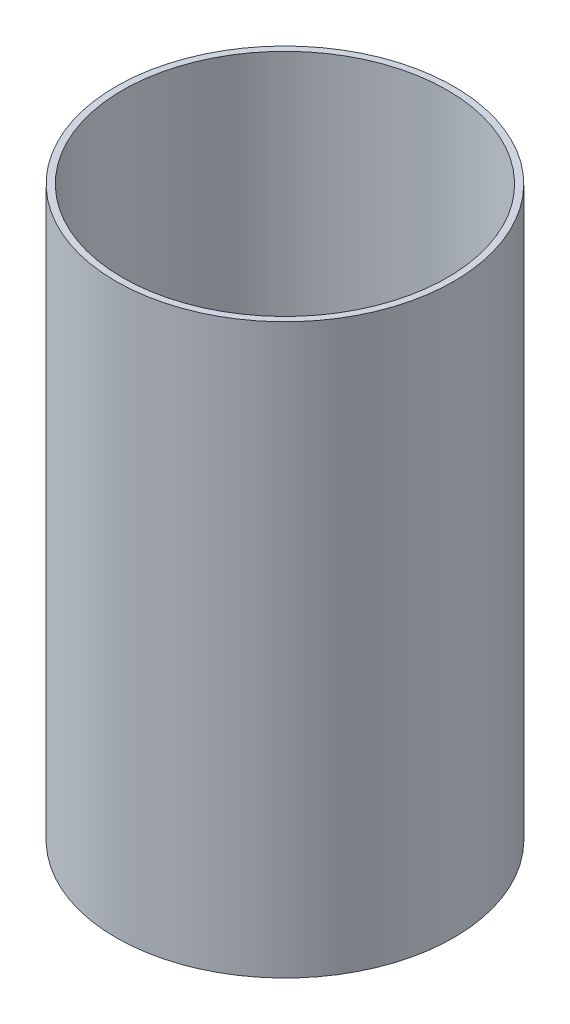
ISO-10303-21;
HEADER;
FILE_DESCRIPTION(('STEP AP214'),'2;1');
FILE_NAME('part.step','',(''),(''),'','','');
FILE_SCHEMA(('AUTOMOTIVE_DESIGN { 1 0 10303 214 1 1 1 1 }'));
ENDSEC;
DATA;
#1=APPLICATION_CONTEXT('core data for automotive mechanical design processes');
#2=APPLICATION_PROTOCOL_DEFINITION('international standard','automotive_design',2000,#1);
#3=PRODUCT_CONTEXT('',#1,'mechanical');
#4=PRODUCT('Part','Part','',(#3));
#5=PRODUCT_RELATED_PRODUCT_CATEGORY('part','',(#4));
#6=PRODUCT_DEFINITION_FORMATION('','',#4);
#7=PRODUCT_DEFINITION_CONTEXT('part definition',#1,'design');
#8=PRODUCT_DEFINITION('design','',#6,#7);
#9=PRODUCT_DEFINITION_SHAPE('','',#8);
#10=(LENGTH_UNIT() NAMED_UNIT(*) SI_UNIT(.MILLI.,.METRE.));
#11=(NAMED_UNIT(*) PLANE_ANGLE_UNIT() SI_UNIT($,.RADIAN.));
#12=(NAMED_UNIT(*) SI_UNIT($,.STERADIAN.) SOLID_ANGLE_UNIT());
#13=UNCERTAINTY_MEASURE_WITH_UNIT(LENGTH_MEASURE(1.E-05),#10,'distance_accuracy_value','');
#14=(GEOMETRIC_REPRESENTATION_CONTEXT(3) GLOBAL_UNCERTAINTY_ASSIGNED_CONTEXT((#13)) GLOBAL_UNIT_ASSIGNED_CONTEXT((#10,
#11,#12)) REPRESENTATION_CONTEXT('',''));
#15=CARTESIAN_POINT('',(0.,0.,0.));
#16=DIRECTION('',(0.,0.,1.));
#17=DIRECTION('',(1.,0.,0.));
#18=AXIS2_PLACEMENT_3D('',#15,#16,#17);
#19=CARTESIAN_POINT('',(0.,55.,0.));
#20=DIRECTION('',(0.,1.,0.));
#21=DIRECTION('',(0.,0.,1.));
#22=AXIS2_PLACEMENT_3D('',#19,#20,#21);
#23=CYLINDRICAL_SURFACE('',#22,39.624);
#24=CARTESIAN_POINT('',(0.,-133.35,0.));
#25=DIRECTION('',(0.,1.,0.));
#26=DIRECTION('',(0.,0.,1.));
#27=AXIS2_PLACEMENT_3D('',#24,#25,#26);
#28=CIRCLE('',#27,39.624);
#29=CARTESIAN_POINT('',(0.,-133.35,39.624));
#30=VERTEX_POINT('',#29);
#31=EDGE_CURVE('E10',#30,#30,#28,.T.);
#32=ORIENTED_EDGE('',*,*,#31,.T.);
#33=EDGE_LOOP('',(#32));
#34=FACE_BOUND('',#33,.T.);
#35=CARTESIAN_POINT('',(0.,0.,0.));
#36=DIRECTION('',(0.,1.,0.));
#37=DIRECTION('',(0.,0.,1.));
#38=AXIS2_PLACEMENT_3D('',#35,#36,#37);
#39=CIRCLE('',#38,39.624);
#40=CARTESIAN_POINT('',(0.,0.,39.624));
#41=VERTEX_POINT('',#40);
#42=EDGE_CURVE('E47',#41,#41,#39,.T.);
#43=ORIENTED_EDGE('',*,*,#42,.F.);
#44=EDGE_LOOP('',(#43));
#45=FACE_BOUND('',#44,.T.);
#46=ADVANCED_FACE('F33',(#34,#45),#23,.T.);
#47=CARTESIAN_POINT('',(-39.624,-133.35,0.));
#48=DIRECTION('',(0.,-1.,0.));
#49=DIRECTION('',(0.,0.,-1.));
#50=AXIS2_PLACEMENT_3D('',#47,#48,#49);
#51=PLANE('',#50);
#52=CARTESIAN_POINT('',(0.,-133.35,0.));
#53=DIRECTION('',(0.,1.,0.));
#54=DIRECTION('',(0.,0.,1.));
#55=AXIS2_PLACEMENT_3D('',#52,#53,#54);
#56=CIRCLE('',#55,38.1);
#57=CARTESIAN_POINT('',(0.,-133.35,38.1));
#58=VERTEX_POINT('',#57);
#59=EDGE_CURVE('E39',#58,#58,#56,.T.);
#60=ORIENTED_EDGE('',*,*,#59,.T.);
#61=EDGE_LOOP('',(#60));
#62=FACE_BOUND('',#61,.T.);
#63=ORIENTED_EDGE('',*,*,#31,.F.);
#64=EDGE_LOOP('',(#63));
#65=FACE_BOUND('',#64,.T.);
#66=ADVANCED_FACE('F57',(#62,#65),#51,.T.);
#67=CARTESIAN_POINT('',(0.,55.,0.));
#68=DIRECTION('',(0.,1.,0.));
#69=DIRECTION('',(0.,0.,1.));
#70=AXIS2_PLACEMENT_3D('',#67,#68,#69);
#71=CYLINDRICAL_SURFACE('',#70,38.1);
#72=CARTESIAN_POINT('',(0.,0.,0.));
#73=DIRECTION('',(0.,1.,0.));
#74=DIRECTION('',(0.,0.,1.));
#75=AXIS2_PLACEMENT_3D('',#72,#73,#74);
#76=CIRCLE('',#75,38.1);
#77=CARTESIAN_POINT('',(0.,0.,38.1));
#78=VERTEX_POINT('',#77);
#79=EDGE_CURVE('E43',#78,#78,#76,.T.);
#80=ORIENTED_EDGE('',*,*,#79,.T.);
#81=EDGE_LOOP('',(#80));
#82=FACE_BOUND('',#81,.T.);
#83=ORIENTED_EDGE('',*,*,#59,.F.);
#84=EDGE_LOOP('',(#83));
#85=FACE_BOUND('',#84,.T.);
#86=ADVANCED_FACE('F61',(#82,#85),#71,.F.);
#87=CARTESIAN_POINT('',(-39.624,0.,0.));
#88=DIRECTION('',(0.,1.,0.));
#89=DIRECTION('',(0.,0.,1.));
#90=AXIS2_PLACEMENT_3D('',#87,#88,#89);
#91=PLANE('',#90);
#92=ORIENTED_EDGE('',*,*,#42,.T.);
#93=EDGE_LOOP('',(#92));
#94=FACE_BOUND('',#93,.T.);
#95=ORIENTED_EDGE('',*,*,#79,.F.);
#96=EDGE_LOOP('',(#95));
#97=FACE_BOUND('',#96,.T.);
#98=ADVANCED_FACE('F53',(#94,#97),#91,.T.);
#99=CLOSED_SHELL('',(#46,#66,#86,#98));
#100=MANIFOLD_SOLID_BREP('B2',#99);
#101=ADVANCED_BREP_SHAPE_REPRESENTATION('',(#18,#100),#14);
#102=SHAPE_DEFINITION_REPRESENTATION(#9,#101);
ENDSEC;
END-ISO-10303-21;
